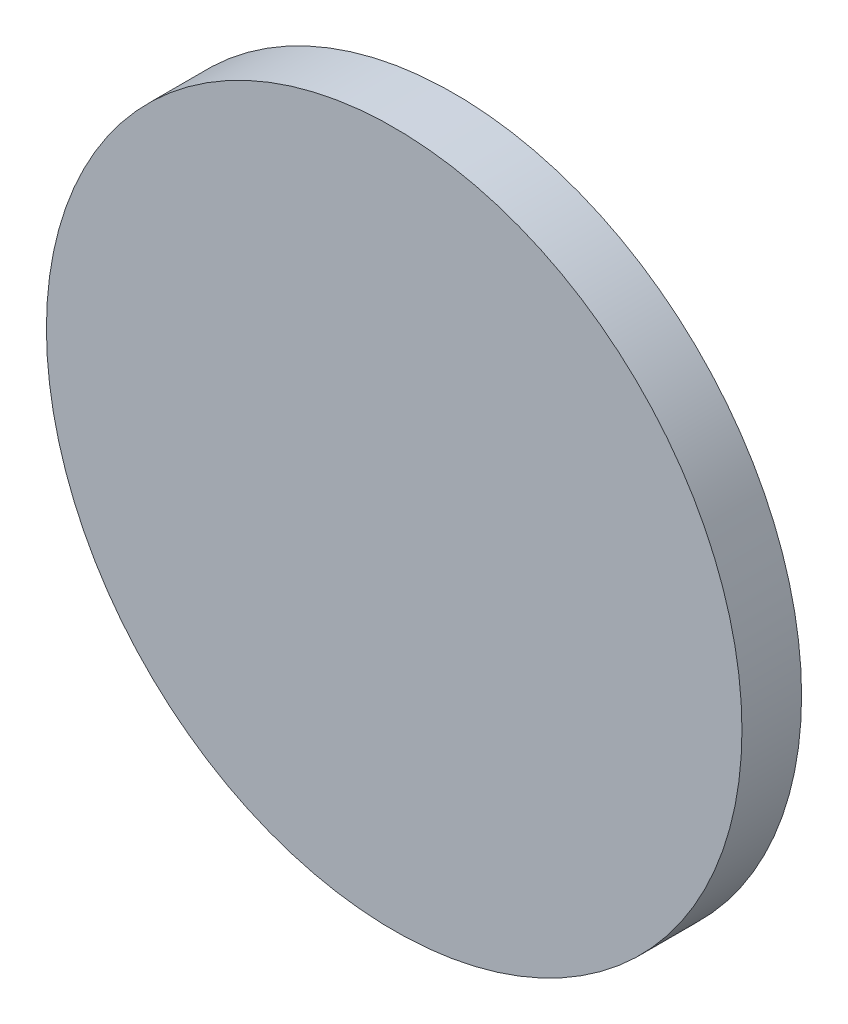
ISO-10303-21;
HEADER;
FILE_DESCRIPTION(('STEP AP214'),'2;1');
FILE_NAME('part.step','',(''),(''),'','','');
FILE_SCHEMA(('AUTOMOTIVE_DESIGN { 1 0 10303 214 1 1 1 1 }'));
ENDSEC;
DATA;
#1=APPLICATION_CONTEXT('core data for automotive mechanical design processes');
#2=APPLICATION_PROTOCOL_DEFINITION('international standard','automotive_design',2000,#1);
#3=PRODUCT_CONTEXT('',#1,'mechanical');
#4=PRODUCT('Part','Part','',(#3));
#5=PRODUCT_RELATED_PRODUCT_CATEGORY('part','',(#4));
#6=PRODUCT_DEFINITION_FORMATION('','',#4);
#7=PRODUCT_DEFINITION_CONTEXT('part definition',#1,'design');
#8=PRODUCT_DEFINITION('design','',#6,#7);
#9=PRODUCT_DEFINITION_SHAPE('','',#8);
#10=(LENGTH_UNIT() NAMED_UNIT(*) SI_UNIT(.MILLI.,.METRE.));
#11=(NAMED_UNIT(*) PLANE_ANGLE_UNIT() SI_UNIT($,.RADIAN.));
#12=(NAMED_UNIT(*) SI_UNIT($,.STERADIAN.) SOLID_ANGLE_UNIT());
#13=UNCERTAINTY_MEASURE_WITH_UNIT(LENGTH_MEASURE(1.E-05),#10,'distance_accuracy_value','');
#14=(GEOMETRIC_REPRESENTATION_CONTEXT(3) GLOBAL_UNCERTAINTY_ASSIGNED_CONTEXT((#13)) GLOBAL_UNIT_ASSIGNED_CONTEXT((#10,
#11,#12)) REPRESENTATION_CONTEXT('',''));
#15=CARTESIAN_POINT('',(0.,0.,0.));
#16=DIRECTION('',(0.,0.,1.));
#17=DIRECTION('',(1.,0.,0.));
#18=AXIS2_PLACEMENT_3D('',#15,#16,#17);
#19=CARTESIAN_POINT('',(1.35128,1.610360006176,0.));
#20=DIRECTION('',(0.,0.,-1.));
#21=DIRECTION('',(-1.,0.,0.));
#22=AXIS2_PLACEMENT_3D('',#19,#20,#21);
#23=PLANE('',#22);
#24=CARTESIAN_POINT('',(1.35128,1.610360006176,0.));
#25=DIRECTION('',(0.,0.,1.));
#26=DIRECTION('',(1.,0.,0.));
#27=AXIS2_PLACEMENT_3D('',#24,#25,#26);
#28=CIRCLE('',#27,0.200024667);
#29=CARTESIAN_POINT('',(1.551304667,1.610360006176,0.));
#30=VERTEX_POINT('',#29);
#31=EDGE_CURVE('E18',#30,#30,#28,.T.);
#32=ORIENTED_EDGE('',*,*,#31,.F.);
#33=EDGE_LOOP('',(#32));
#34=FACE_BOUND('',#33,.T.);
#35=ADVANCED_FACE('F15',(#34),#23,.T.);
#36=CARTESIAN_POINT('',(1.35128,1.610360006176,0.));
#37=DIRECTION('',(0.,0.,1.));
#38=DIRECTION('',(1.,0.,0.));
#39=AXIS2_PLACEMENT_3D('',#36,#37,#38);
#40=CYLINDRICAL_SURFACE('',#39,0.200024667);
#41=CARTESIAN_POINT('',(1.35128,1.610360006176,0.03429));
#42=DIRECTION('',(0.,0.,1.));
#43=DIRECTION('',(1.,0.,0.));
#44=AXIS2_PLACEMENT_3D('',#41,#42,#43);
#45=CIRCLE('',#44,0.200024667);
#46=CARTESIAN_POINT('',(1.551304667,1.610360006176,0.03429));
#47=VERTEX_POINT('',#46);
#48=EDGE_CURVE('E10',#47,#47,#45,.T.);
#49=ORIENTED_EDGE('',*,*,#48,.F.);
#50=EDGE_LOOP('',(#49));
#51=FACE_BOUND('',#50,.T.);
#52=ORIENTED_EDGE('',*,*,#31,.T.);
#53=EDGE_LOOP('',(#52));
#54=FACE_BOUND('',#53,.T.);
#55=ADVANCED_FACE('F27',(#51,#54),#40,.T.);
#56=CARTESIAN_POINT('',(1.35128,1.610360006176,0.03429));
#57=DIRECTION('',(0.,0.,1.));
#58=DIRECTION('',(1.,0.,0.));
#59=AXIS2_PLACEMENT_3D('',#56,#57,#58);
#60=PLANE('',#59);
#61=ORIENTED_EDGE('',*,*,#48,.T.);
#62=EDGE_LOOP('',(#61));
#63=FACE_BOUND('',#62,.T.);
#64=ADVANCED_FACE('F34',(#63),#60,.T.);
#65=CLOSED_SHELL('',(#35,#55,#64));
#66=MANIFOLD_SOLID_BREP('B1',#65);
#67=ADVANCED_BREP_SHAPE_REPRESENTATION('',(#18,#66),#14);
#68=SHAPE_DEFINITION_REPRESENTATION(#9,#67);
ENDSEC;
END-ISO-10303-21;
